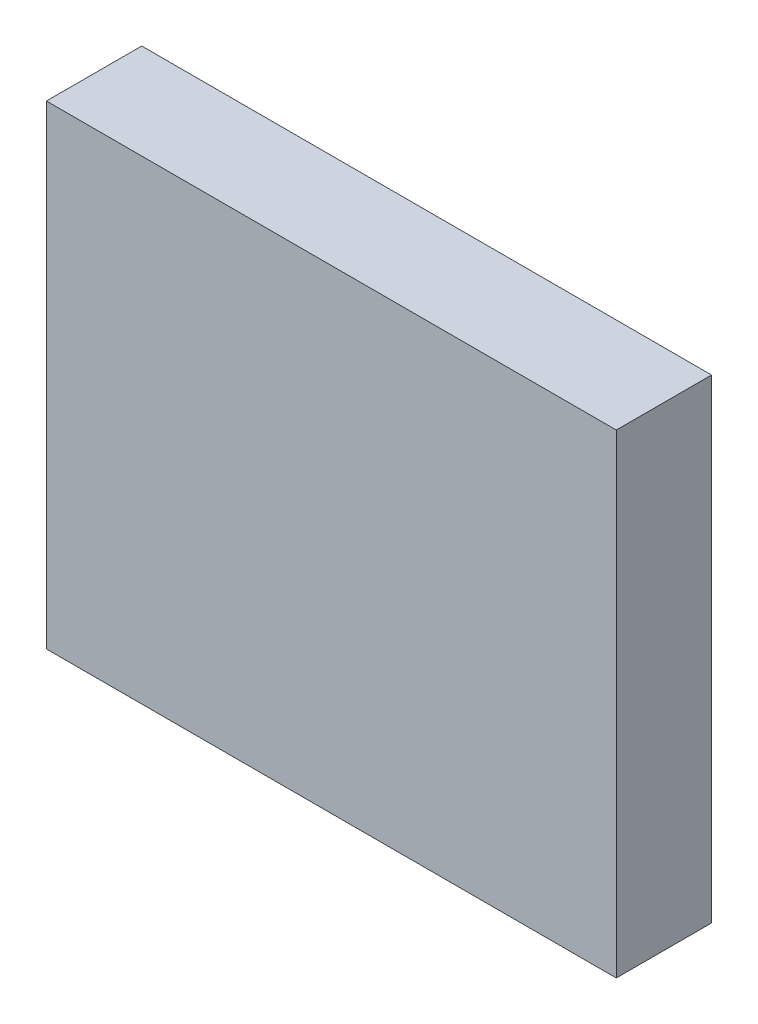
ISO-10303-21;
HEADER;
FILE_DESCRIPTION(('STEP AP214'),'2;1');
FILE_NAME('part.step','',(''),(''),'','','');
FILE_SCHEMA(('AUTOMOTIVE_DESIGN { 1 0 10303 214 1 1 1 1 }'));
ENDSEC;
DATA;
#1=APPLICATION_CONTEXT('core data for automotive mechanical design processes');
#2=APPLICATION_PROTOCOL_DEFINITION('international standard','automotive_design',2000,#1);
#3=PRODUCT_CONTEXT('',#1,'mechanical');
#4=PRODUCT('Part','Part','',(#3));
#5=PRODUCT_RELATED_PRODUCT_CATEGORY('part','',(#4));
#6=PRODUCT_DEFINITION_FORMATION('','',#4);
#7=PRODUCT_DEFINITION_CONTEXT('part definition',#1,'design');
#8=PRODUCT_DEFINITION('design','',#6,#7);
#9=PRODUCT_DEFINITION_SHAPE('','',#8);
#10=(LENGTH_UNIT() NAMED_UNIT(*) SI_UNIT(.MILLI.,.METRE.));
#11=(NAMED_UNIT(*) PLANE_ANGLE_UNIT() SI_UNIT($,.RADIAN.));
#12=(NAMED_UNIT(*) SI_UNIT($,.STERADIAN.) SOLID_ANGLE_UNIT());
#13=UNCERTAINTY_MEASURE_WITH_UNIT(LENGTH_MEASURE(1.E-05),#10,'distance_accuracy_value','');
#14=(GEOMETRIC_REPRESENTATION_CONTEXT(3) GLOBAL_UNCERTAINTY_ASSIGNED_CONTEXT((#13)) GLOBAL_UNIT_ASSIGNED_CONTEXT((#10,
#11,#12)) REPRESENTATION_CONTEXT('',''));
#15=CARTESIAN_POINT('',(0.,0.,0.));
#16=DIRECTION('',(0.,0.,1.));
#17=DIRECTION('',(1.,0.,0.));
#18=AXIS2_PLACEMENT_3D('',#15,#16,#17);
#19=CARTESIAN_POINT('',(0.698,-0.127,0.));
#20=DIRECTION('',(0.,-1.,0.));
#21=DIRECTION('',(0.,0.,1.));
#22=AXIS2_PLACEMENT_3D('',#19,#20,#21);
#23=PLANE('',#22);
#24=DIRECTION('',(-1.,0.,0.));
#25=VECTOR('',#24,1.);
#26=CARTESIAN_POINT('',(1.003,-0.127,0.));
#27=LINE('',#26,#25);
#28=CARTESIAN_POINT('',(1.003,-0.127,0.));
#29=VERTEX_POINT('',#28);
#30=CARTESIAN_POINT('',(0.698,-0.127,0.));
#31=VERTEX_POINT('',#30);
#32=EDGE_CURVE('E11',#29,#31,#27,.T.);
#33=ORIENTED_EDGE('',*,*,#32,.F.);
#34=DIRECTION('',(0.,0.,-1.));
#35=VECTOR('',#34,1.);
#36=CARTESIAN_POINT('',(1.003,-0.127,0.051));
#37=LINE('',#36,#35);
#38=CARTESIAN_POINT('',(1.003,-0.127,0.051));
#39=VERTEX_POINT('',#38);
#40=EDGE_CURVE('E24',#39,#29,#37,.T.);
#41=ORIENTED_EDGE('',*,*,#40,.F.);
#42=DIRECTION('',(1.,0.,0.));
#43=VECTOR('',#42,1.);
#44=CARTESIAN_POINT('',(0.698,-0.127,0.051));
#45=LINE('',#44,#43);
#46=CARTESIAN_POINT('',(0.698,-0.127,0.051));
#47=VERTEX_POINT('',#46);
#48=EDGE_CURVE('E88',#47,#39,#45,.T.);
#49=ORIENTED_EDGE('',*,*,#48,.F.);
#50=DIRECTION('',(0.,0.,1.));
#51=VECTOR('',#50,1.);
#52=CARTESIAN_POINT('',(0.698,-0.127,0.));
#53=LINE('',#52,#51);
#54=EDGE_CURVE('E77',#31,#47,#53,.T.);
#55=ORIENTED_EDGE('',*,*,#54,.F.);
#56=EDGE_LOOP('',(#33,#41,#49,#55));
#57=FACE_BOUND('',#56,.T.);
#58=ADVANCED_FACE('F17',(#57),#23,.T.);
#59=CARTESIAN_POINT('',(1.003,-0.127,0.));
#60=DIRECTION('',(1.,0.,0.));
#61=DIRECTION('',(0.,0.,1.));
#62=AXIS2_PLACEMENT_3D('',#59,#60,#61);
#63=PLANE('',#62);
#64=DIRECTION('',(0.,-1.,0.));
#65=VECTOR('',#64,1.);
#66=CARTESIAN_POINT('',(1.003,0.127,0.));
#67=LINE('',#66,#65);
#68=CARTESIAN_POINT('',(1.003,0.127,0.));
#69=VERTEX_POINT('',#68);
#70=EDGE_CURVE('E85',#69,#29,#67,.T.);
#71=ORIENTED_EDGE('',*,*,#70,.F.);
#72=DIRECTION('',(0.,0.,-1.));
#73=VECTOR('',#72,1.);
#74=CARTESIAN_POINT('',(1.003,0.127,0.051));
#75=LINE('',#74,#73);
#76=CARTESIAN_POINT('',(1.003,0.127,0.051));
#77=VERTEX_POINT('',#76);
#78=EDGE_CURVE('E83',#77,#69,#75,.T.);
#79=ORIENTED_EDGE('',*,*,#78,.F.);
#80=DIRECTION('',(0.,1.,0.));
#81=VECTOR('',#80,1.);
#82=CARTESIAN_POINT('',(1.003,-0.127,0.051));
#83=LINE('',#82,#81);
#84=EDGE_CURVE('E72',#39,#77,#83,.T.);
#85=ORIENTED_EDGE('',*,*,#84,.F.);
#86=ORIENTED_EDGE('',*,*,#40,.T.);
#87=EDGE_LOOP('',(#71,#79,#85,#86));
#88=FACE_BOUND('',#87,.T.);
#89=ADVANCED_FACE('F90',(#88),#63,.T.);
#90=CARTESIAN_POINT('',(1.003,0.127,0.));
#91=DIRECTION('',(0.,1.,0.));
#92=DIRECTION('',(0.,0.,1.));
#93=AXIS2_PLACEMENT_3D('',#90,#91,#92);
#94=PLANE('',#93);
#95=DIRECTION('',(1.,0.,0.));
#96=VECTOR('',#95,1.);
#97=CARTESIAN_POINT('',(0.698,0.127,0.));
#98=LINE('',#97,#96);
#99=CARTESIAN_POINT('',(0.698,0.127,0.));
#100=VERTEX_POINT('',#99);
#101=EDGE_CURVE('E60',#100,#69,#98,.T.);
#102=ORIENTED_EDGE('',*,*,#101,.F.);
#103=DIRECTION('',(0.,0.,-1.));
#104=VECTOR('',#103,1.);
#105=CARTESIAN_POINT('',(0.698,0.127,0.051));
#106=LINE('',#105,#104);
#107=CARTESIAN_POINT('',(0.698,0.127,0.051));
#108=VERTEX_POINT('',#107);
#109=EDGE_CURVE('E54',#108,#100,#106,.T.);
#110=ORIENTED_EDGE('',*,*,#109,.F.);
#111=DIRECTION('',(-1.,0.,0.));
#112=VECTOR('',#111,1.);
#113=CARTESIAN_POINT('',(1.003,0.127,0.051));
#114=LINE('',#113,#112);
#115=EDGE_CURVE('E58',#77,#108,#114,.T.);
#116=ORIENTED_EDGE('',*,*,#115,.F.);
#117=ORIENTED_EDGE('',*,*,#78,.T.);
#118=EDGE_LOOP('',(#102,#110,#116,#117));
#119=FACE_BOUND('',#118,.T.);
#120=ADVANCED_FACE('F56',(#119),#94,.T.);
#121=CARTESIAN_POINT('',(0.698,0.127,0.));
#122=DIRECTION('',(-1.,0.,0.));
#123=DIRECTION('',(0.,0.,1.));
#124=AXIS2_PLACEMENT_3D('',#121,#122,#123);
#125=PLANE('',#124);
#126=DIRECTION('',(0.,1.,0.));
#127=VECTOR('',#126,1.);
#128=CARTESIAN_POINT('',(0.698,-0.127,0.));
#129=LINE('',#128,#127);
#130=EDGE_CURVE('E73',#31,#100,#129,.T.);
#131=ORIENTED_EDGE('',*,*,#130,.F.);
#132=ORIENTED_EDGE('',*,*,#54,.T.);
#133=DIRECTION('',(0.,-1.,0.));
#134=VECTOR('',#133,1.);
#135=CARTESIAN_POINT('',(0.698,0.127,0.051));
#136=LINE('',#135,#134);
#137=EDGE_CURVE('E70',#108,#47,#136,.T.);
#138=ORIENTED_EDGE('',*,*,#137,.F.);
#139=ORIENTED_EDGE('',*,*,#109,.T.);
#140=EDGE_LOOP('',(#131,#132,#138,#139));
#141=FACE_BOUND('',#140,.T.);
#142=ADVANCED_FACE('F76',(#141),#125,.T.);
#143=CARTESIAN_POINT('',(0.698,0.127,0.));
#144=DIRECTION('',(0.,0.,-1.));
#145=DIRECTION('',(0.,1.,0.));
#146=AXIS2_PLACEMENT_3D('',#143,#144,#145);
#147=PLANE('',#146);
#148=ORIENTED_EDGE('',*,*,#101,.T.);
#149=ORIENTED_EDGE('',*,*,#70,.T.);
#150=ORIENTED_EDGE('',*,*,#32,.T.);
#151=ORIENTED_EDGE('',*,*,#130,.T.);
#152=EDGE_LOOP('',(#148,#149,#150,#151));
#153=FACE_BOUND('',#152,.T.);
#154=ADVANCED_FACE('F91',(#153),#147,.T.);
#155=CARTESIAN_POINT('',(0.698,-0.127,0.051));
#156=DIRECTION('',(0.,0.,1.));
#157=DIRECTION('',(0.,1.,0.));
#158=AXIS2_PLACEMENT_3D('',#155,#156,#157);
#159=PLANE('',#158);
#160=ORIENTED_EDGE('',*,*,#48,.T.);
#161=ORIENTED_EDGE('',*,*,#84,.T.);
#162=ORIENTED_EDGE('',*,*,#115,.T.);
#163=ORIENTED_EDGE('',*,*,#137,.T.);
#164=EDGE_LOOP('',(#160,#161,#162,#163));
#165=FACE_BOUND('',#164,.T.);
#166=ADVANCED_FACE('F69',(#165),#159,.T.);
#167=CLOSED_SHELL('',(#58,#89,#120,#142,#154,#166));
#168=MANIFOLD_SOLID_BREP('B1',#167);
#169=ADVANCED_BREP_SHAPE_REPRESENTATION('',(#18,#168),#14);
#170=SHAPE_DEFINITION_REPRESENTATION(#9,#169);
ENDSEC;
END-ISO-10303-21;
